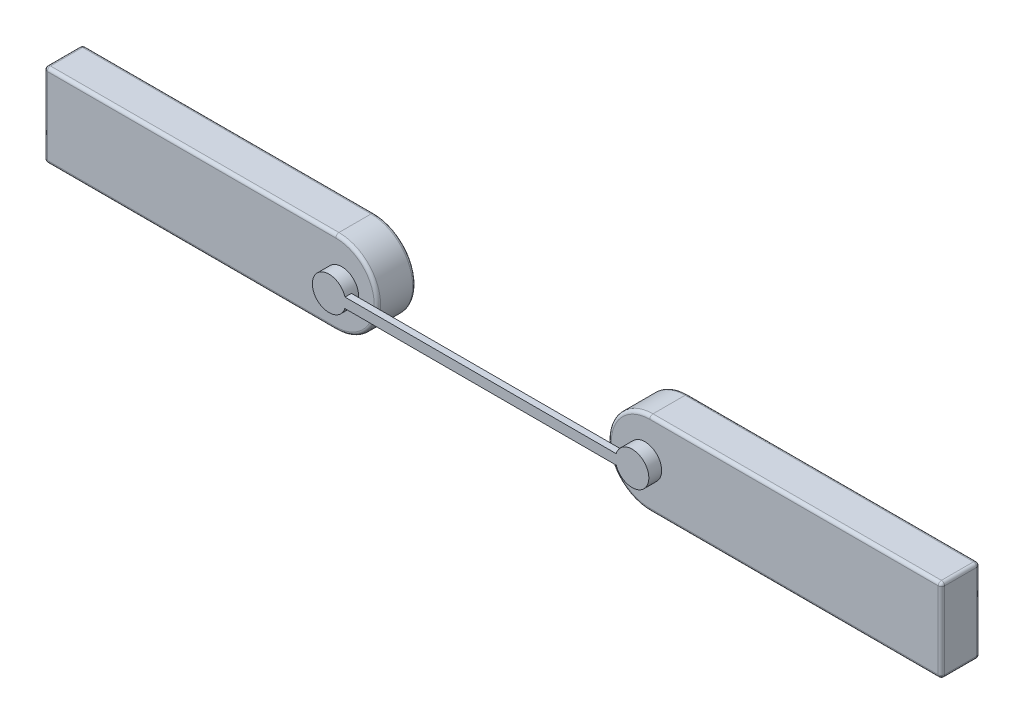
ISO-10303-21;
HEADER;
FILE_DESCRIPTION(('STEP AP214'),'2;1');
FILE_NAME('part.step','',(''),(''),'','','');
FILE_SCHEMA(('AUTOMOTIVE_DESIGN { 1 0 10303 214 1 1 1 1 }'));
ENDSEC;
DATA;
#1=APPLICATION_CONTEXT('core data for automotive mechanical design processes');
#2=APPLICATION_PROTOCOL_DEFINITION('international standard','automotive_design',2000,#1);
#3=PRODUCT_CONTEXT('',#1,'mechanical');
#4=PRODUCT('Part','Part','',(#3));
#5=PRODUCT_RELATED_PRODUCT_CATEGORY('part','',(#4));
#6=PRODUCT_DEFINITION_FORMATION('','',#4);
#7=PRODUCT_DEFINITION_CONTEXT('part definition',#1,'design');
#8=PRODUCT_DEFINITION('design','',#6,#7);
#9=PRODUCT_DEFINITION_SHAPE('','',#8);
#10=(LENGTH_UNIT() NAMED_UNIT(*) SI_UNIT(.MILLI.,.METRE.));
#11=(NAMED_UNIT(*) PLANE_ANGLE_UNIT() SI_UNIT($,.RADIAN.));
#12=(NAMED_UNIT(*) SI_UNIT($,.STERADIAN.) SOLID_ANGLE_UNIT());
#13=UNCERTAINTY_MEASURE_WITH_UNIT(LENGTH_MEASURE(1.E-05),#10,'distance_accuracy_value','');
#14=(GEOMETRIC_REPRESENTATION_CONTEXT(3) GLOBAL_UNCERTAINTY_ASSIGNED_CONTEXT((#13)) GLOBAL_UNIT_ASSIGNED_CONTEXT((#10,
#11,#12)) REPRESENTATION_CONTEXT('',''));
#15=CARTESIAN_POINT('',(0.,0.,0.));
#16=DIRECTION('',(0.,0.,1.));
#17=DIRECTION('',(1.,0.,0.));
#18=AXIS2_PLACEMENT_3D('',#15,#16,#17);
#19=CARTESIAN_POINT('',(-2.26404410227311,0.,0.));
#20=DIRECTION('',(0.,0.,1.));
#21=DIRECTION('',(1.,0.,0.));
#22=AXIS2_PLACEMENT_3D('',#19,#20,#21);
#23=PLANE('',#22);
#24=DIRECTION('',(1.,0.,0.));
#25=VECTOR('',#24,1.);
#26=CARTESIAN_POINT('',(-2.31327205113655,-0.3,0.));
#27=LINE('',#26,#25);
#28=CARTESIAN_POINT('',(-3.475,-0.3,0.));
#29=VERTEX_POINT('',#28);
#30=CARTESIAN_POINT('',(-1.225,-0.3,0.));
#31=VERTEX_POINT('',#30);
#32=EDGE_CURVE('E410',#29,#31,#27,.T.);
#33=ORIENTED_EDGE('',*,*,#32,.F.);
#34=DIRECTION('',(0.,1.,0.));
#35=VECTOR('',#34,1.);
#36=CARTESIAN_POINT('',(-3.475,0.,0.));
#37=LINE('',#36,#35);
#38=CARTESIAN_POINT('',(-3.475,0.3,0.));
#39=VERTEX_POINT('',#38);
#40=EDGE_CURVE('E499',#39,#29,#37,.F.);
#41=ORIENTED_EDGE('',*,*,#40,.F.);
#42=DIRECTION('',(-1.,0.,0.));
#43=VECTOR('',#42,1.);
#44=CARTESIAN_POINT('',(-2.31327205113655,0.3,0.));
#45=LINE('',#44,#43);
#46=CARTESIAN_POINT('',(-1.225,0.3,0.));
#47=VERTEX_POINT('',#46);
#48=EDGE_CURVE('E369',#47,#39,#45,.T.);
#49=ORIENTED_EDGE('',*,*,#48,.F.);
#50=CARTESIAN_POINT('',(-1.225,0.,0.));
#51=DIRECTION('',(0.,0.,1.));
#52=DIRECTION('',(0.,-1.,0.));
#53=AXIS2_PLACEMENT_3D('',#50,#51,#52);
#54=CIRCLE('',#53,0.3);
#55=EDGE_CURVE('E379',#31,#47,#54,.T.);
#56=ORIENTED_EDGE('',*,*,#55,.F.);
#57=EDGE_LOOP('',(#33,#41,#49,#56));
#58=FACE_BOUND('',#57,.T.);
#59=ADVANCED_FACE('F17',(#58),#23,.F.);
#60=CARTESIAN_POINT('',(-3.475,0.3,0.025));
#61=DIRECTION('',(1.,0.,0.));
#62=DIRECTION('',(0.,1.,0.));
#63=AXIS2_PLACEMENT_3D('',#60,#61,#62);
#64=SPHERICAL_SURFACE('',#63,0.025);
#65=CARTESIAN_POINT('',(-3.475,0.3,0.025));
#66=DIRECTION('',(0.,0.,-1.));
#67=DIRECTION('',(-1.,0.,0.));
#68=AXIS2_PLACEMENT_3D('',#65,#66,#67);
#69=CIRCLE('',#68,0.025);
#70=CARTESIAN_POINT('',(-3.475,0.325,0.025));
#71=VERTEX_POINT('',#70);
#72=CARTESIAN_POINT('',(-3.5,0.3,0.025));
#73=VERTEX_POINT('',#72);
#74=EDGE_CURVE('E361',#71,#73,#69,.F.);
#75=ORIENTED_EDGE('',*,*,#74,.F.);
#76=CARTESIAN_POINT('',(-3.475,0.3,0.025));
#77=DIRECTION('',(-1.,0.,0.));
#78=DIRECTION('',(0.,-1.,0.));
#79=AXIS2_PLACEMENT_3D('',#76,#77,#78);
#80=CIRCLE('',#79,0.025);
#81=EDGE_CURVE('E376',#39,#71,#80,.F.);
#82=ORIENTED_EDGE('',*,*,#81,.F.);
#83=CARTESIAN_POINT('',(-3.475,0.3,0.025));
#84=DIRECTION('',(0.,-1.,0.));
#85=DIRECTION('',(0.,0.,-1.));
#86=AXIS2_PLACEMENT_3D('',#83,#84,#85);
#87=CIRCLE('',#86,0.025);
#88=EDGE_CURVE('E351',#73,#39,#87,.T.);
#89=ORIENTED_EDGE('',*,*,#88,.F.);
#90=EDGE_LOOP('',(#75,#82,#89));
#91=FACE_BOUND('',#90,.T.);
#92=ADVANCED_FACE('F493',(#91),#64,.T.);
#93=CARTESIAN_POINT('',(-3.475,-0.3,0.025));
#94=DIRECTION('',(1.,0.,0.));
#95=DIRECTION('',(0.,1.,0.));
#96=AXIS2_PLACEMENT_3D('',#93,#94,#95);
#97=SPHERICAL_SURFACE('',#96,0.025);
#98=CARTESIAN_POINT('',(-3.475,-0.3,0.025));
#99=DIRECTION('',(0.,0.,-1.));
#100=DIRECTION('',(-1.,0.,0.));
#101=AXIS2_PLACEMENT_3D('',#98,#99,#100);
#102=CIRCLE('',#101,0.025);
#103=CARTESIAN_POINT('',(-3.5,-0.3,0.025));
#104=VERTEX_POINT('',#103);
#105=CARTESIAN_POINT('',(-3.475,-0.325,0.025));
#106=VERTEX_POINT('',#105);
#107=EDGE_CURVE('E347',#104,#106,#102,.F.);
#108=ORIENTED_EDGE('',*,*,#107,.F.);
#109=CARTESIAN_POINT('',(-3.475,-0.3,0.025));
#110=DIRECTION('',(0.,-1.,0.));
#111=DIRECTION('',(0.,0.,-1.));
#112=AXIS2_PLACEMENT_3D('',#109,#110,#111);
#113=CIRCLE('',#112,0.025);
#114=EDGE_CURVE('E359',#29,#104,#113,.F.);
#115=ORIENTED_EDGE('',*,*,#114,.F.);
#116=CARTESIAN_POINT('',(-3.475,-0.3,0.025));
#117=DIRECTION('',(1.,0.,0.));
#118=DIRECTION('',(0.,1.,0.));
#119=AXIS2_PLACEMENT_3D('',#116,#117,#118);
#120=CIRCLE('',#119,0.025);
#121=EDGE_CURVE('E417',#106,#29,#120,.T.);
#122=ORIENTED_EDGE('',*,*,#121,.F.);
#123=EDGE_LOOP('',(#108,#115,#122));
#124=FACE_BOUND('',#123,.T.);
#125=ADVANCED_FACE('F502',(#124),#97,.T.);
#126=CARTESIAN_POINT('',(-2.31327205113655,-0.3,0.025));
#127=DIRECTION('',(1.,0.,0.));
#128=DIRECTION('',(0.,1.,0.));
#129=AXIS2_PLACEMENT_3D('',#126,#127,#128);
#130=CYLINDRICAL_SURFACE('',#129,0.025);
#131=ORIENTED_EDGE('',*,*,#121,.T.);
#132=ORIENTED_EDGE('',*,*,#32,.T.);
#133=CARTESIAN_POINT('',(-1.225,-0.3,0.025));
#134=DIRECTION('',(1.,0.,0.));
#135=DIRECTION('',(0.,-1.,0.));
#136=AXIS2_PLACEMENT_3D('',#133,#134,#135);
#137=CIRCLE('',#136,0.025);
#138=CARTESIAN_POINT('',(-1.225,-0.325,0.025));
#139=VERTEX_POINT('',#138);
#140=EDGE_CURVE('E391',#139,#31,#137,.T.);
#141=ORIENTED_EDGE('',*,*,#140,.F.);
#142=DIRECTION('',(1.,0.,0.));
#143=VECTOR('',#142,1.);
#144=CARTESIAN_POINT('',(-2.3625,-0.325,0.025));
#145=LINE('',#144,#143);
#146=EDGE_CURVE('E338',#106,#139,#145,.T.);
#147=ORIENTED_EDGE('',*,*,#146,.F.);
#148=EDGE_LOOP('',(#131,#132,#141,#147));
#149=FACE_BOUND('',#148,.T.);
#150=ADVANCED_FACE('F400',(#149),#130,.T.);
#151=CARTESIAN_POINT('',(-1.225,0.,0.025));
#152=DIRECTION('',(0.,0.,1.));
#153=DIRECTION('',(1.,0.,0.));
#154=AXIS2_PLACEMENT_3D('',#151,#152,#153);
#155=TOROIDAL_SURFACE('',#154,0.3,0.025);
#156=CARTESIAN_POINT('',(-1.225,0.3,0.025));
#157=DIRECTION('',(-1.,0.,0.));
#158=DIRECTION('',(0.,-1.,0.));
#159=AXIS2_PLACEMENT_3D('',#156,#157,#158);
#160=CIRCLE('',#159,0.025);
#161=CARTESIAN_POINT('',(-1.225,0.325,0.025));
#162=VERTEX_POINT('',#161);
#163=EDGE_CURVE('E378',#162,#47,#160,.T.);
#164=ORIENTED_EDGE('',*,*,#163,.F.);
#165=CARTESIAN_POINT('',(-1.225,0.,0.025));
#166=DIRECTION('',(0.,0.,-1.));
#167=DIRECTION('',(-1.,0.,0.));
#168=AXIS2_PLACEMENT_3D('',#165,#166,#167);
#169=CIRCLE('',#168,0.325);
#170=EDGE_CURVE('E329',#139,#162,#169,.F.);
#171=ORIENTED_EDGE('',*,*,#170,.F.);
#172=ORIENTED_EDGE('',*,*,#140,.T.);
#173=ORIENTED_EDGE('',*,*,#55,.T.);
#174=EDGE_LOOP('',(#164,#171,#172,#173));
#175=FACE_BOUND('',#174,.T.);
#176=ADVANCED_FACE('F394',(#175),#155,.T.);
#177=CARTESIAN_POINT('',(-2.31327205113655,0.3,0.025));
#178=DIRECTION('',(-1.,0.,0.));
#179=DIRECTION('',(0.,-1.,0.));
#180=AXIS2_PLACEMENT_3D('',#177,#178,#179);
#181=CYLINDRICAL_SURFACE('',#180,0.025);
#182=ORIENTED_EDGE('',*,*,#163,.T.);
#183=ORIENTED_EDGE('',*,*,#48,.T.);
#184=ORIENTED_EDGE('',*,*,#81,.T.);
#185=DIRECTION('',(-1.,0.,0.));
#186=VECTOR('',#185,1.);
#187=CARTESIAN_POINT('',(-2.3625,0.325,0.025));
#188=LINE('',#187,#186);
#189=EDGE_CURVE('E323',#162,#71,#188,.T.);
#190=ORIENTED_EDGE('',*,*,#189,.F.);
#191=EDGE_LOOP('',(#182,#183,#184,#190));
#192=FACE_BOUND('',#191,.T.);
#193=ADVANCED_FACE('F399',(#192),#181,.T.);
#194=CARTESIAN_POINT('',(-3.475,0.3,0.3));
#195=DIRECTION('',(0.,0.,-1.));
#196=DIRECTION('',(-1.,0.,0.));
#197=AXIS2_PLACEMENT_3D('',#194,#195,#196);
#198=CYLINDRICAL_SURFACE('',#197,0.025);
#199=CARTESIAN_POINT('',(-3.475,0.3,0.275));
#200=DIRECTION('',(0.,0.,1.));
#201=DIRECTION('',(1.,0.,0.));
#202=AXIS2_PLACEMENT_3D('',#199,#200,#201);
#203=CIRCLE('',#202,0.025);
#204=CARTESIAN_POINT('',(-3.475,0.325,0.275));
#205=VERTEX_POINT('',#204);
#206=CARTESIAN_POINT('',(-3.5,0.3,0.275));
#207=VERTEX_POINT('',#206);
#208=EDGE_CURVE('E287',#205,#207,#203,.T.);
#209=ORIENTED_EDGE('',*,*,#208,.F.);
#210=DIRECTION('',(0.,0.,1.));
#211=VECTOR('',#210,1.);
#212=CARTESIAN_POINT('',(-3.475,0.325,0.3));
#213=LINE('',#212,#211);
#214=EDGE_CURVE('E309',#71,#205,#213,.T.);
#215=ORIENTED_EDGE('',*,*,#214,.F.);
#216=ORIENTED_EDGE('',*,*,#74,.T.);
#217=DIRECTION('',(0.,0.,1.));
#218=VECTOR('',#217,1.);
#219=CARTESIAN_POINT('',(-3.5,0.3,0.3));
#220=LINE('',#219,#218);
#221=EDGE_CURVE('E356',#207,#73,#220,.F.);
#222=ORIENTED_EDGE('',*,*,#221,.F.);
#223=EDGE_LOOP('',(#209,#215,#216,#222));
#224=FACE_BOUND('',#223,.T.);
#225=ADVANCED_FACE('F481',(#224),#198,.T.);
#226=CARTESIAN_POINT('',(-3.475,-0.0812499999999997,0.025));
#227=DIRECTION('',(0.,-1.,0.));
#228=DIRECTION('',(0.,0.,-1.));
#229=AXIS2_PLACEMENT_3D('',#226,#227,#228);
#230=CYLINDRICAL_SURFACE('',#229,0.025);
#231=ORIENTED_EDGE('',*,*,#88,.T.);
#232=ORIENTED_EDGE('',*,*,#40,.T.);
#233=ORIENTED_EDGE('',*,*,#114,.T.);
#234=DIRECTION('',(0.,1.,0.));
#235=VECTOR('',#234,1.);
#236=CARTESIAN_POINT('',(-3.5,-0.1625,0.025));
#237=LINE('',#236,#235);
#238=EDGE_CURVE('E313',#73,#104,#237,.F.);
#239=ORIENTED_EDGE('',*,*,#238,.F.);
#240=EDGE_LOOP('',(#231,#232,#233,#239));
#241=FACE_BOUND('',#240,.T.);
#242=ADVANCED_FACE('F497',(#241),#230,.T.);
#243=CARTESIAN_POINT('',(-3.475,-0.3,0.3));
#244=DIRECTION('',(0.,0.,-1.));
#245=DIRECTION('',(-1.,0.,0.));
#246=AXIS2_PLACEMENT_3D('',#243,#244,#245);
#247=CYLINDRICAL_SURFACE('',#246,0.025);
#248=CARTESIAN_POINT('',(-3.475,-0.3,0.275));
#249=DIRECTION('',(0.,0.,-1.));
#250=DIRECTION('',(1.,0.,0.));
#251=AXIS2_PLACEMENT_3D('',#248,#249,#250);
#252=CIRCLE('',#251,0.025);
#253=CARTESIAN_POINT('',(-3.5,-0.3,0.275));
#254=VERTEX_POINT('',#253);
#255=CARTESIAN_POINT('',(-3.475,-0.325,0.275));
#256=VERTEX_POINT('',#255);
#257=EDGE_CURVE('E307',#254,#256,#252,.F.);
#258=ORIENTED_EDGE('',*,*,#257,.F.);
#259=DIRECTION('',(0.,0.,1.));
#260=VECTOR('',#259,1.);
#261=CARTESIAN_POINT('',(-3.5,-0.3,0.3));
#262=LINE('',#261,#260);
#263=EDGE_CURVE('E276',#104,#254,#262,.T.);
#264=ORIENTED_EDGE('',*,*,#263,.F.);
#265=ORIENTED_EDGE('',*,*,#107,.T.);
#266=DIRECTION('',(0.,0.,1.));
#267=VECTOR('',#266,1.);
#268=CARTESIAN_POINT('',(-3.475,-0.325,0.3));
#269=LINE('',#268,#267);
#270=EDGE_CURVE('E344',#256,#106,#269,.F.);
#271=ORIENTED_EDGE('',*,*,#270,.F.);
#272=EDGE_LOOP('',(#258,#264,#265,#271));
#273=FACE_BOUND('',#272,.T.);
#274=ADVANCED_FACE('F464',(#273),#247,.T.);
#275=CARTESIAN_POINT('',(-2.3625,-0.325,0.3));
#276=DIRECTION('',(0.,-1.,0.));
#277=DIRECTION('',(1.,0.,0.));
#278=AXIS2_PLACEMENT_3D('',#275,#276,#277);
#279=PLANE('',#278);
#280=ORIENTED_EDGE('',*,*,#146,.T.);
#281=DIRECTION('',(0.,0.,-1.));
#282=VECTOR('',#281,1.);
#283=CARTESIAN_POINT('',(-1.225,-0.325,0.3));
#284=LINE('',#283,#282);
#285=CARTESIAN_POINT('',(-1.225,-0.325,0.275));
#286=VERTEX_POINT('',#285);
#287=EDGE_CURVE('E335',#286,#139,#284,.T.);
#288=ORIENTED_EDGE('',*,*,#287,.F.);
#289=DIRECTION('',(1.,0.,0.));
#290=VECTOR('',#289,1.);
#291=CARTESIAN_POINT('',(-2.31327205113655,-0.325,0.275));
#292=LINE('',#291,#290);
#293=EDGE_CURVE('E270',#256,#286,#292,.T.);
#294=ORIENTED_EDGE('',*,*,#293,.F.);
#295=ORIENTED_EDGE('',*,*,#270,.T.);
#296=EDGE_LOOP('',(#280,#288,#294,#295));
#297=FACE_BOUND('',#296,.T.);
#298=ADVANCED_FACE('F470',(#297),#279,.T.);
#299=CARTESIAN_POINT('',(-1.225,0.,0.3));
#300=DIRECTION('',(0.,0.,-1.));
#301=DIRECTION('',(-1.,0.,0.));
#302=AXIS2_PLACEMENT_3D('',#299,#300,#301);
#303=CYLINDRICAL_SURFACE('',#302,0.325);
#304=ORIENTED_EDGE('',*,*,#170,.T.);
#305=DIRECTION('',(0.,0.,1.));
#306=VECTOR('',#305,1.);
#307=CARTESIAN_POINT('',(-1.225,0.325,0.3));
#308=LINE('',#307,#306);
#309=CARTESIAN_POINT('',(-1.225,0.325,0.275));
#310=VERTEX_POINT('',#309);
#311=EDGE_CURVE('E326',#310,#162,#308,.F.);
#312=ORIENTED_EDGE('',*,*,#311,.F.);
#313=CARTESIAN_POINT('',(-1.225,0.,0.275));
#314=DIRECTION('',(0.,0.,-1.));
#315=DIRECTION('',(1.,0.,0.));
#316=AXIS2_PLACEMENT_3D('',#313,#314,#315);
#317=CIRCLE('',#316,0.325);
#318=EDGE_CURVE('E269',#286,#310,#317,.F.);
#319=ORIENTED_EDGE('',*,*,#318,.F.);
#320=ORIENTED_EDGE('',*,*,#287,.T.);
#321=EDGE_LOOP('',(#304,#312,#319,#320));
#322=FACE_BOUND('',#321,.T.);
#323=ADVANCED_FACE('F476',(#322),#303,.T.);
#324=CARTESIAN_POINT('',(-2.3625,0.325,0.3));
#325=DIRECTION('',(0.,1.,0.));
#326=DIRECTION('',(-1.,0.,0.));
#327=AXIS2_PLACEMENT_3D('',#324,#325,#326);
#328=PLANE('',#327);
#329=ORIENTED_EDGE('',*,*,#189,.T.);
#330=ORIENTED_EDGE('',*,*,#214,.T.);
#331=DIRECTION('',(-1.,0.,0.));
#332=VECTOR('',#331,1.);
#333=CARTESIAN_POINT('',(-2.31327205113655,0.325,0.275));
#334=LINE('',#333,#332);
#335=EDGE_CURVE('E316',#310,#205,#334,.T.);
#336=ORIENTED_EDGE('',*,*,#335,.F.);
#337=ORIENTED_EDGE('',*,*,#311,.T.);
#338=EDGE_LOOP('',(#329,#330,#336,#337));
#339=FACE_BOUND('',#338,.T.);
#340=ADVANCED_FACE('F299',(#339),#328,.T.);
#341=CARTESIAN_POINT('',(-3.475,-0.3,0.275));
#342=DIRECTION('',(1.,0.,0.));
#343=DIRECTION('',(0.,1.,0.));
#344=AXIS2_PLACEMENT_3D('',#341,#342,#343);
#345=SPHERICAL_SURFACE('',#344,0.025);
#346=CARTESIAN_POINT('',(-3.475,-0.3,0.275));
#347=DIRECTION('',(1.,0.,0.));
#348=DIRECTION('',(0.,1.,0.));
#349=AXIS2_PLACEMENT_3D('',#346,#347,#348);
#350=CIRCLE('',#349,0.025);
#351=CARTESIAN_POINT('',(-3.475,-0.3,0.3));
#352=VERTEX_POINT('',#351);
#353=EDGE_CURVE('E273',#352,#256,#350,.T.);
#354=ORIENTED_EDGE('',*,*,#353,.F.);
#355=CARTESIAN_POINT('',(-3.475,-0.3,0.275));
#356=DIRECTION('',(0.,-1.,0.));
#357=DIRECTION('',(0.,0.,-1.));
#358=AXIS2_PLACEMENT_3D('',#355,#356,#357);
#359=CIRCLE('',#358,0.025);
#360=EDGE_CURVE('E279',#254,#352,#359,.F.);
#361=ORIENTED_EDGE('',*,*,#360,.F.);
#362=ORIENTED_EDGE('',*,*,#257,.T.);
#363=EDGE_LOOP('',(#354,#361,#362));
#364=FACE_BOUND('',#363,.T.);
#365=ADVANCED_FACE('F294',(#364),#345,.T.);
#366=CARTESIAN_POINT('',(-3.475,0.3,0.275));
#367=DIRECTION('',(1.,0.,0.));
#368=DIRECTION('',(0.,1.,0.));
#369=AXIS2_PLACEMENT_3D('',#366,#367,#368);
#370=SPHERICAL_SURFACE('',#369,0.025);
#371=CARTESIAN_POINT('',(-3.475,0.3,0.275));
#372=DIRECTION('',(-1.,0.,0.));
#373=DIRECTION('',(0.,-1.,0.));
#374=AXIS2_PLACEMENT_3D('',#371,#372,#373);
#375=CIRCLE('',#374,0.025);
#376=CARTESIAN_POINT('',(-3.475,0.3,0.3));
#377=VERTEX_POINT('',#376);
#378=EDGE_CURVE('E282',#205,#377,#375,.F.);
#379=ORIENTED_EDGE('',*,*,#378,.F.);
#380=ORIENTED_EDGE('',*,*,#208,.T.);
#381=CARTESIAN_POINT('',(-3.475,0.3,0.275));
#382=DIRECTION('',(0.,-1.,0.));
#383=DIRECTION('',(0.,0.,-1.));
#384=AXIS2_PLACEMENT_3D('',#381,#382,#383);
#385=CIRCLE('',#384,0.025);
#386=EDGE_CURVE('E281',#377,#207,#385,.T.);
#387=ORIENTED_EDGE('',*,*,#386,.F.);
#388=EDGE_LOOP('',(#379,#380,#387));
#389=FACE_BOUND('',#388,.T.);
#390=ADVANCED_FACE('F290',(#389),#370,.T.);
#391=CARTESIAN_POINT('',(-3.5,-0.1625,0.3));
#392=DIRECTION('',(-1.,0.,0.));
#393=DIRECTION('',(0.,0.,1.));
#394=AXIS2_PLACEMENT_3D('',#391,#392,#393);
#395=PLANE('',#394);
#396=ORIENTED_EDGE('',*,*,#263,.T.);
#397=DIRECTION('',(0.,-1.,0.));
#398=VECTOR('',#397,1.);
#399=CARTESIAN_POINT('',(-3.5,-0.0812499999999997,0.275));
#400=LINE('',#399,#398);
#401=EDGE_CURVE('E184',#207,#254,#400,.T.);
#402=ORIENTED_EDGE('',*,*,#401,.F.);
#403=ORIENTED_EDGE('',*,*,#221,.T.);
#404=ORIENTED_EDGE('',*,*,#238,.T.);
#405=EDGE_LOOP('',(#396,#402,#403,#404));
#406=FACE_BOUND('',#405,.T.);
#407=ADVANCED_FACE('F293',(#406),#395,.T.);
#408=CARTESIAN_POINT('',(-2.31327205113655,-0.3,0.275));
#409=DIRECTION('',(1.,0.,0.));
#410=DIRECTION('',(0.,1.,0.));
#411=AXIS2_PLACEMENT_3D('',#408,#409,#410);
#412=CYLINDRICAL_SURFACE('',#411,0.025);
#413=ORIENTED_EDGE('',*,*,#353,.T.);
#414=ORIENTED_EDGE('',*,*,#293,.T.);
#415=CARTESIAN_POINT('',(-1.225,-0.3,0.275));
#416=DIRECTION('',(-1.,0.,0.));
#417=DIRECTION('',(0.,-1.,0.));
#418=AXIS2_PLACEMENT_3D('',#415,#416,#417);
#419=CIRCLE('',#418,0.025);
#420=CARTESIAN_POINT('',(-1.225,-0.3,0.3));
#421=VERTEX_POINT('',#420);
#422=EDGE_CURVE('E262',#421,#286,#419,.F.);
#423=ORIENTED_EDGE('',*,*,#422,.F.);
#424=DIRECTION('',(1.,0.,0.));
#425=VECTOR('',#424,1.);
#426=CARTESIAN_POINT('',(-2.26404410227311,-0.3,0.3));
#427=LINE('',#426,#425);
#428=EDGE_CURVE('E429',#352,#421,#427,.T.);
#429=ORIENTED_EDGE('',*,*,#428,.F.);
#430=EDGE_LOOP('',(#413,#414,#423,#429));
#431=FACE_BOUND('',#430,.T.);
#432=ADVANCED_FACE('F249',(#431),#412,.T.);
#433=CARTESIAN_POINT('',(-1.225,0.,0.275));
#434=DIRECTION('',(0.,0.,-1.));
#435=DIRECTION('',(1.,0.,0.));
#436=AXIS2_PLACEMENT_3D('',#433,#434,#435);
#437=TOROIDAL_SURFACE('',#436,0.3,0.025);
#438=CARTESIAN_POINT('',(-1.225,0.3,0.275));
#439=DIRECTION('',(-1.,0.,0.));
#440=DIRECTION('',(0.,-1.,0.));
#441=AXIS2_PLACEMENT_3D('',#438,#439,#440);
#442=CIRCLE('',#441,0.025);
#443=CARTESIAN_POINT('',(-1.225,0.3,0.3));
#444=VERTEX_POINT('',#443);
#445=EDGE_CURVE('E319',#444,#310,#442,.T.);
#446=ORIENTED_EDGE('',*,*,#445,.F.);
#447=CARTESIAN_POINT('',(-1.225,0.,0.3));
#448=DIRECTION('',(0.,0.,-1.));
#449=DIRECTION('',(0.,1.,0.));
#450=AXIS2_PLACEMENT_3D('',#447,#448,#449);
#451=CIRCLE('',#450,0.3);
#452=EDGE_CURVE('E215',#421,#444,#451,.F.);
#453=ORIENTED_EDGE('',*,*,#452,.F.);
#454=ORIENTED_EDGE('',*,*,#422,.T.);
#455=ORIENTED_EDGE('',*,*,#318,.T.);
#456=EDGE_LOOP('',(#446,#453,#454,#455));
#457=FACE_BOUND('',#456,.T.);
#458=ADVANCED_FACE('F243',(#457),#437,.T.);
#459=CARTESIAN_POINT('',(-2.31327205113655,0.3,0.275));
#460=DIRECTION('',(-1.,0.,0.));
#461=DIRECTION('',(0.,-1.,0.));
#462=AXIS2_PLACEMENT_3D('',#459,#460,#461);
#463=CYLINDRICAL_SURFACE('',#462,0.025);
#464=ORIENTED_EDGE('',*,*,#378,.T.);
#465=DIRECTION('',(1.,0.,0.));
#466=VECTOR('',#465,1.);
#467=CARTESIAN_POINT('',(-2.26404410227311,0.3,0.3));
#468=LINE('',#467,#466);
#469=EDGE_CURVE('E221',#444,#377,#468,.F.);
#470=ORIENTED_EDGE('',*,*,#469,.F.);
#471=ORIENTED_EDGE('',*,*,#445,.T.);
#472=ORIENTED_EDGE('',*,*,#335,.T.);
#473=EDGE_LOOP('',(#464,#470,#471,#472));
#474=FACE_BOUND('',#473,.T.);
#475=ADVANCED_FACE('F239',(#474),#463,.T.);
#476=CARTESIAN_POINT('',(-3.475,-0.0812499999999997,0.275));
#477=DIRECTION('',(0.,-1.,0.));
#478=DIRECTION('',(0.,0.,-1.));
#479=AXIS2_PLACEMENT_3D('',#476,#477,#478);
#480=CYLINDRICAL_SURFACE('',#479,0.025);
#481=ORIENTED_EDGE('',*,*,#386,.T.);
#482=ORIENTED_EDGE('',*,*,#401,.T.);
#483=ORIENTED_EDGE('',*,*,#360,.T.);
#484=DIRECTION('',(0.,1.,0.));
#485=VECTOR('',#484,1.);
#486=CARTESIAN_POINT('',(-3.475,0.,0.3));
#487=LINE('',#486,#485);
#488=EDGE_CURVE('E208',#377,#352,#487,.F.);
#489=ORIENTED_EDGE('',*,*,#488,.F.);
#490=EDGE_LOOP('',(#481,#482,#483,#489));
#491=FACE_BOUND('',#490,.T.);
#492=ADVANCED_FACE('F236',(#491),#480,.T.);
#493=CARTESIAN_POINT('',(-1.17754991258794,0.,0.4));
#494=DIRECTION('',(0.,0.,1.));
#495=DIRECTION('',(1.,0.,0.));
#496=AXIS2_PLACEMENT_3D('',#493,#494,#495);
#497=PLANE('',#496);
#498=DIRECTION('',(1.,0.,0.));
#499=VECTOR('',#498,1.);
#500=CARTESIAN_POINT('',(-0.00188594796703023,-0.0405715299206022,0.4));
#501=LINE('',#500,#499);
#502=CARTESIAN_POINT('',(1.06361107278188,-0.0405715299206022,0.4));
#503=VERTEX_POINT('',#502);
#504=CARTESIAN_POINT('',(-1.05394264045783,-0.0405715299206012,0.4));
#505=VERTEX_POINT('',#504);
#506=EDGE_CURVE('E179',#503,#505,#501,.F.);
#507=ORIENTED_EDGE('',*,*,#506,.F.);
#508=CARTESIAN_POINT('',(1.187218344912,0.,0.4));
#509=DIRECTION('',(0.,0.,1.));
#510=DIRECTION('',(0.,-1.,0.));
#511=AXIS2_PLACEMENT_3D('',#508,#509,#510);
#512=CIRCLE('',#511,0.130095375642435);
#513=CARTESIAN_POINT('',(1.06254152609611,0.0371550482908656,0.4));
#514=VERTEX_POINT('',#513);
#515=EDGE_CURVE('E183',#503,#514,#512,.T.);
#516=ORIENTED_EDGE('',*,*,#515,.T.);
#517=DIRECTION('',(1.,0.,0.));
#518=VECTOR('',#517,1.);
#519=CARTESIAN_POINT('',(-0.00188594796703023,0.0371550482908656,0.4));
#520=LINE('',#519,#518);
#521=CARTESIAN_POINT('',(-1.05287309377205,0.0371550482908653,0.4));
#522=VERTEX_POINT('',#521);
#523=EDGE_CURVE('E181',#522,#514,#520,.T.);
#524=ORIENTED_EDGE('',*,*,#523,.F.);
#525=CARTESIAN_POINT('',(-1.17754991258794,0.,0.4));
#526=DIRECTION('',(0.,0.,1.));
#527=DIRECTION('',(0.,-1.,0.));
#528=AXIS2_PLACEMENT_3D('',#525,#526,#527);
#529=CIRCLE('',#528,0.130095375642435);
#530=EDGE_CURVE('E21',#522,#505,#529,.T.);
#531=ORIENTED_EDGE('',*,*,#530,.T.);
#532=EDGE_LOOP('',(#507,#516,#524,#531));
#533=FACE_BOUND('',#532,.T.);
#534=ADVANCED_FACE('F178',(#533),#497,.T.);
#535=CARTESIAN_POINT('',(-2.26404410227311,0.,0.3));
#536=DIRECTION('',(0.,0.,1.));
#537=DIRECTION('',(1.,0.,0.));
#538=AXIS2_PLACEMENT_3D('',#535,#536,#537);
#539=PLANE('',#538);
#540=ORIENTED_EDGE('',*,*,#469,.T.);
#541=ORIENTED_EDGE('',*,*,#488,.T.);
#542=ORIENTED_EDGE('',*,*,#428,.T.);
#543=ORIENTED_EDGE('',*,*,#452,.T.);
#544=EDGE_LOOP('',(#540,#541,#542,#543));
#545=FACE_BOUND('',#544,.T.);
#546=CARTESIAN_POINT('',(-1.17754991258794,0.,0.3));
#547=DIRECTION('',(0.,0.,1.));
#548=DIRECTION('',(0.,-1.,0.));
#549=AXIS2_PLACEMENT_3D('',#546,#547,#548);
#550=CIRCLE('',#549,0.130095375642435);
#551=CARTESIAN_POINT('',(-1.17754991258794,-0.130095375642435,0.3));
#552=VERTEX_POINT('',#551);
#553=EDGE_CURVE('E203',#552,#552,#550,.T.);
#554=ORIENTED_EDGE('',*,*,#553,.F.);
#555=EDGE_LOOP('',(#554));
#556=FACE_BOUND('',#555,.T.);
#557=ADVANCED_FACE('F223',(#545,#556),#539,.T.);
#558=CARTESIAN_POINT('',(-0.00188594796703023,-0.0405715299206022,0.4));
#559=DIRECTION('',(0.,-1.,0.));
#560=DIRECTION('',(0.,0.,-1.));
#561=AXIS2_PLACEMENT_3D('',#558,#559,#560);
#562=PLANE('',#561);
#563=DIRECTION('',(0.,0.,-1.));
#564=VECTOR('',#563,1.);
#565=CARTESIAN_POINT('',(1.06361107278188,-0.0405715299206022,0.4));
#566=LINE('',#565,#564);
#567=CARTESIAN_POINT('',(1.06361107278188,-0.0405715299206022,0.35));
#568=VERTEX_POINT('',#567);
#569=EDGE_CURVE('E191',#568,#503,#566,.F.);
#570=ORIENTED_EDGE('',*,*,#569,.T.);
#571=ORIENTED_EDGE('',*,*,#506,.T.);
#572=DIRECTION('',(0.,0.,1.));
#573=VECTOR('',#572,1.);
#574=CARTESIAN_POINT('',(-1.05394264045783,-0.0405715299206003,0.3));
#575=LINE('',#574,#573);
#576=CARTESIAN_POINT('',(-1.05394264045783,-0.0405715299206012,0.35));
#577=VERTEX_POINT('',#576);
#578=EDGE_CURVE('E189',#577,#505,#575,.T.);
#579=ORIENTED_EDGE('',*,*,#578,.F.);
#580=DIRECTION('',(1.,0.,0.));
#581=VECTOR('',#580,1.);
#582=CARTESIAN_POINT('',(-0.00188594796703023,-0.0405715299206022,0.35));
#583=LINE('',#582,#581);
#584=EDGE_CURVE('E198',#577,#568,#583,.T.);
#585=ORIENTED_EDGE('',*,*,#584,.T.);
#586=EDGE_LOOP('',(#570,#571,#579,#585));
#587=FACE_BOUND('',#586,.T.);
#588=ADVANCED_FACE('F187',(#587),#562,.T.);
#589=CARTESIAN_POINT('',(-0.00188594796703023,0.0371550482908656,0.4));
#590=DIRECTION('',(0.,1.,0.));
#591=DIRECTION('',(0.,0.,1.));
#592=AXIS2_PLACEMENT_3D('',#589,#590,#591);
#593=PLANE('',#592);
#594=DIRECTION('',(0.,0.,1.));
#595=VECTOR('',#594,1.);
#596=CARTESIAN_POINT('',(1.06254152609611,0.0371550482908656,0.4));
#597=LINE('',#596,#595);
#598=CARTESIAN_POINT('',(1.06254152609611,0.0371550482908656,0.35));
#599=VERTEX_POINT('',#598);
#600=EDGE_CURVE('E206',#514,#599,#597,.F.);
#601=ORIENTED_EDGE('',*,*,#600,.T.);
#602=DIRECTION('',(1.,0.,0.));
#603=VECTOR('',#602,1.);
#604=CARTESIAN_POINT('',(-0.00188594796703023,0.0371550482908656,0.35));
#605=LINE('',#604,#603);
#606=CARTESIAN_POINT('',(-1.05287309377205,0.0371550482908653,0.35));
#607=VERTEX_POINT('',#606);
#608=EDGE_CURVE('E201',#599,#607,#605,.F.);
#609=ORIENTED_EDGE('',*,*,#608,.T.);
#610=DIRECTION('',(0.,0.,1.));
#611=VECTOR('',#610,1.);
#612=CARTESIAN_POINT('',(-1.05287309377205,0.037155048290865,0.3));
#613=LINE('',#612,#611);
#614=EDGE_CURVE('E199',#522,#607,#613,.F.);
#615=ORIENTED_EDGE('',*,*,#614,.F.);
#616=ORIENTED_EDGE('',*,*,#523,.T.);
#617=EDGE_LOOP('',(#601,#609,#615,#616));
#618=FACE_BOUND('',#617,.T.);
#619=ADVANCED_FACE('F716',(#618),#593,.T.);
#620=CARTESIAN_POINT('',(-1.17754991258794,0.,0.3));
#621=DIRECTION('',(0.,0.,1.));
#622=DIRECTION('',(0.,-1.,0.));
#623=AXIS2_PLACEMENT_3D('',#620,#621,#622);
#624=CYLINDRICAL_SURFACE('',#623,0.130095375642435);
#625=ORIENTED_EDGE('',*,*,#578,.T.);
#626=ORIENTED_EDGE('',*,*,#530,.F.);
#627=ORIENTED_EDGE('',*,*,#614,.T.);
#628=CARTESIAN_POINT('',(-1.17754991258794,0.,0.35));
#629=DIRECTION('',(0.,0.,1.));
#630=DIRECTION('',(0.,-1.,0.));
#631=AXIS2_PLACEMENT_3D('',#628,#629,#630);
#632=CIRCLE('',#631,0.130095375642435);
#633=EDGE_CURVE('E197',#607,#577,#632,.F.);
#634=ORIENTED_EDGE('',*,*,#633,.T.);
#635=EDGE_LOOP('',(#625,#626,#627,#634));
#636=FACE_BOUND('',#635,.T.);
#637=ORIENTED_EDGE('',*,*,#553,.T.);
#638=EDGE_LOOP('',(#637));
#639=FACE_BOUND('',#638,.T.);
#640=ADVANCED_FACE('F194',(#636,#639),#624,.T.);
#641=CARTESIAN_POINT('',(-0.00188594796703023,-0.00170824081486831,0.35));
#642=DIRECTION('',(0.,0.,1.));
#643=DIRECTION('',(1.,0.,0.));
#644=AXIS2_PLACEMENT_3D('',#641,#642,#643);
#645=PLANE('',#644);
#646=ORIENTED_EDGE('',*,*,#608,.F.);
#647=CARTESIAN_POINT('',(1.187218344912,0.,0.35));
#648=DIRECTION('',(0.,0.,1.));
#649=DIRECTION('',(0.,-1.,0.));
#650=AXIS2_PLACEMENT_3D('',#647,#648,#649);
#651=CIRCLE('',#650,0.130095375642435);
#652=EDGE_CURVE('E424',#568,#599,#651,.F.);
#653=ORIENTED_EDGE('',*,*,#652,.F.);
#654=ORIENTED_EDGE('',*,*,#584,.F.);
#655=ORIENTED_EDGE('',*,*,#633,.F.);
#656=EDGE_LOOP('',(#646,#653,#654,#655));
#657=FACE_BOUND('',#656,.T.);
#658=ADVANCED_FACE('F720',(#657),#645,.F.);
#659=CARTESIAN_POINT('',(1.187218344912,0.,0.3));
#660=DIRECTION('',(0.,0.,1.));
#661=DIRECTION('',(0.,-1.,0.));
#662=AXIS2_PLACEMENT_3D('',#659,#660,#661);
#663=CYLINDRICAL_SURFACE('',#662,0.130095375642435);
#664=CARTESIAN_POINT('',(1.187218344912,0.,0.3));
#665=DIRECTION('',(0.,0.,1.));
#666=DIRECTION('',(0.,-1.,0.));
#667=AXIS2_PLACEMENT_3D('',#664,#665,#666);
#668=CIRCLE('',#667,0.130095375642435);
#669=CARTESIAN_POINT('',(1.187218344912,-0.130095375642435,0.3));
#670=VERTEX_POINT('',#669);
#671=EDGE_CURVE('E420',#670,#670,#668,.F.);
#672=ORIENTED_EDGE('',*,*,#671,.F.);
#673=EDGE_LOOP('',(#672));
#674=FACE_BOUND('',#673,.T.);
#675=ORIENTED_EDGE('',*,*,#569,.F.);
#676=ORIENTED_EDGE('',*,*,#652,.T.);
#677=ORIENTED_EDGE('',*,*,#600,.F.);
#678=ORIENTED_EDGE('',*,*,#515,.F.);
#679=EDGE_LOOP('',(#675,#676,#677,#678));
#680=FACE_BOUND('',#679,.T.);
#681=ADVANCED_FACE('F722',(#674,#680),#663,.T.);
#682=CARTESIAN_POINT('',(3.475,-0.3,0.275));
#683=DIRECTION('',(1.,0.,0.));
#684=DIRECTION('',(0.,1.,0.));
#685=AXIS2_PLACEMENT_3D('',#682,#683,#684);
#686=SPHERICAL_SURFACE('',#685,0.025);
#687=CARTESIAN_POINT('',(3.475,-0.3,0.275));
#688=DIRECTION('',(1.,0.,0.));
#689=DIRECTION('',(0.,1.,0.));
#690=AXIS2_PLACEMENT_3D('',#687,#688,#689);
#691=CIRCLE('',#690,0.025);
#692=CARTESIAN_POINT('',(3.475,-0.325,0.275));
#693=VERTEX_POINT('',#692);
#694=CARTESIAN_POINT('',(3.475,-0.300000000000016,0.3));
#695=VERTEX_POINT('',#694);
#696=EDGE_CURVE('E1042',#693,#695,#691,.F.);
#697=ORIENTED_EDGE('',*,*,#696,.F.);
#698=CARTESIAN_POINT('',(3.475,-0.3,0.275));
#699=DIRECTION('',(0.,0.,-1.));
#700=DIRECTION('',(-1.,0.,0.));
#701=AXIS2_PLACEMENT_3D('',#698,#699,#700);
#702=CIRCLE('',#701,0.025);
#703=CARTESIAN_POINT('',(3.5,-0.3,0.275));
#704=VERTEX_POINT('',#703);
#705=EDGE_CURVE('E1010',#704,#693,#702,.T.);
#706=ORIENTED_EDGE('',*,*,#705,.F.);
#707=CARTESIAN_POINT('',(3.475,-0.3,0.275));
#708=DIRECTION('',(0.,1.,0.));
#709=DIRECTION('',(0.,0.,1.));
#710=AXIS2_PLACEMENT_3D('',#707,#708,#709);
#711=CIRCLE('',#710,0.025);
#712=EDGE_CURVE('E1035',#695,#704,#711,.T.);
#713=ORIENTED_EDGE('',*,*,#712,.F.);
#714=EDGE_LOOP('',(#697,#706,#713));
#715=FACE_BOUND('',#714,.T.);
#716=ADVANCED_FACE('F724',(#715),#686,.T.);
#717=CARTESIAN_POINT('',(2.26404410227311,0.,0.3));
#718=DIRECTION('',(0.,0.,1.));
#719=DIRECTION('',(1.,0.,0.));
#720=AXIS2_PLACEMENT_3D('',#717,#718,#719);
#721=PLANE('',#720);
#722=DIRECTION('',(1.,0.,0.));
#723=VECTOR('',#722,1.);
#724=CARTESIAN_POINT('',(2.31327205113655,-0.3,0.3));
#725=LINE('',#724,#723);
#726=CARTESIAN_POINT('',(1.225,-0.3,0.3));
#727=VERTEX_POINT('',#726);
#728=EDGE_CURVE('E1044',#695,#727,#725,.F.);
#729=ORIENTED_EDGE('',*,*,#728,.F.);
#730=DIRECTION('',(0.,1.,0.));
#731=VECTOR('',#730,1.);
#732=CARTESIAN_POINT('',(3.475,0.0812500000000004,0.3));
#733=LINE('',#732,#731);
#734=CARTESIAN_POINT('',(3.475,0.3,0.3));
#735=VERTEX_POINT('',#734);
#736=EDGE_CURVE('E1039',#735,#695,#733,.F.);
#737=ORIENTED_EDGE('',*,*,#736,.F.);
#738=DIRECTION('',(-1.,0.,0.));
#739=VECTOR('',#738,1.);
#740=CARTESIAN_POINT('',(2.31327205113655,0.3,0.3));
#741=LINE('',#740,#739);
#742=CARTESIAN_POINT('',(1.225,0.3,0.3));
#743=VERTEX_POINT('',#742);
#744=EDGE_CURVE('E1034',#743,#735,#741,.F.);
#745=ORIENTED_EDGE('',*,*,#744,.F.);
#746=CARTESIAN_POINT('',(1.225,0.,0.3));
#747=DIRECTION('',(0.,0.,-1.));
#748=DIRECTION('',(0.,-1.,0.));
#749=AXIS2_PLACEMENT_3D('',#746,#747,#748);
#750=CIRCLE('',#749,0.3);
#751=EDGE_CURVE('E423',#743,#727,#750,.F.);
#752=ORIENTED_EDGE('',*,*,#751,.T.);
#753=EDGE_LOOP('',(#729,#737,#745,#752));
#754=FACE_BOUND('',#753,.T.);
#755=ORIENTED_EDGE('',*,*,#671,.T.);
#756=EDGE_LOOP('',(#755));
#757=FACE_BOUND('',#756,.T.);
#758=ADVANCED_FACE('F731',(#754,#757),#721,.T.);
#759=CARTESIAN_POINT('',(3.475,0.3,0.275));
#760=DIRECTION('',(1.,0.,0.));
#761=DIRECTION('',(0.,1.,0.));
#762=AXIS2_PLACEMENT_3D('',#759,#760,#761);
#763=SPHERICAL_SURFACE('',#762,0.025);
#764=CARTESIAN_POINT('',(3.475,0.3,0.275));
#765=DIRECTION('',(-1.,0.,0.));
#766=DIRECTION('',(0.,-1.,0.));
#767=AXIS2_PLACEMENT_3D('',#764,#765,#766);
#768=CIRCLE('',#767,0.025);
#769=CARTESIAN_POINT('',(3.475,0.325,0.275));
#770=VERTEX_POINT('',#769);
#771=EDGE_CURVE('E1054',#735,#770,#768,.T.);
#772=ORIENTED_EDGE('',*,*,#771,.F.);
#773=CARTESIAN_POINT('',(3.475,0.3,0.275));
#774=DIRECTION('',(0.,1.,0.));
#775=DIRECTION('',(0.,0.,1.));
#776=AXIS2_PLACEMENT_3D('',#773,#774,#775);
#777=CIRCLE('',#776,0.025);
#778=CARTESIAN_POINT('',(3.5,0.3,0.275));
#779=VERTEX_POINT('',#778);
#780=EDGE_CURVE('E1049',#779,#735,#777,.F.);
#781=ORIENTED_EDGE('',*,*,#780,.F.);
#782=CARTESIAN_POINT('',(3.475,0.3,0.275));
#783=DIRECTION('',(0.,0.,-1.));
#784=DIRECTION('',(-1.,0.,0.));
#785=AXIS2_PLACEMENT_3D('',#782,#783,#784);
#786=CIRCLE('',#785,0.025);
#787=EDGE_CURVE('E1022',#770,#779,#786,.T.);
#788=ORIENTED_EDGE('',*,*,#787,.F.);
#789=EDGE_LOOP('',(#772,#781,#788));
#790=FACE_BOUND('',#789,.T.);
#791=ADVANCED_FACE('F887',(#790),#763,.T.);
#792=CARTESIAN_POINT('',(2.31327205113655,-0.3,0.275));
#793=DIRECTION('',(1.,0.,0.));
#794=DIRECTION('',(0.,1.,0.));
#795=AXIS2_PLACEMENT_3D('',#792,#793,#794);
#796=CYLINDRICAL_SURFACE('',#795,0.025);
#797=ORIENTED_EDGE('',*,*,#696,.T.);
#798=ORIENTED_EDGE('',*,*,#728,.T.);
#799=CARTESIAN_POINT('',(1.225,-0.3,0.275));
#800=DIRECTION('',(-1.,0.,0.));
#801=DIRECTION('',(0.,-1.,0.));
#802=AXIS2_PLACEMENT_3D('',#799,#800,#801);
#803=CIRCLE('',#802,0.025);
#804=CARTESIAN_POINT('',(1.225,-0.325,0.275));
#805=VERTEX_POINT('',#804);
#806=EDGE_CURVE('E678',#805,#727,#803,.T.);
#807=ORIENTED_EDGE('',*,*,#806,.F.);
#808=DIRECTION('',(1.,0.,0.));
#809=VECTOR('',#808,1.);
#810=CARTESIAN_POINT('',(2.3625,-0.325,0.275));
#811=LINE('',#810,#809);
#812=EDGE_CURVE('E674',#693,#805,#811,.F.);
#813=ORIENTED_EDGE('',*,*,#812,.F.);
#814=EDGE_LOOP('',(#797,#798,#807,#813));
#815=FACE_BOUND('',#814,.T.);
#816=ADVANCED_FACE('F894',(#815),#796,.T.);
#817=CARTESIAN_POINT('',(3.475,0.0812500000000004,0.275));
#818=DIRECTION('',(0.,1.,0.));
#819=DIRECTION('',(0.,0.,1.));
#820=AXIS2_PLACEMENT_3D('',#817,#818,#819);
#821=CYLINDRICAL_SURFACE('',#820,0.025);
#822=ORIENTED_EDGE('',*,*,#712,.T.);
#823=DIRECTION('',(0.,1.,0.));
#824=VECTOR('',#823,1.);
#825=CARTESIAN_POINT('',(3.5,0.1625,0.275));
#826=LINE('',#825,#824);
#827=EDGE_CURVE('E655',#779,#704,#826,.F.);
#828=ORIENTED_EDGE('',*,*,#827,.F.);
#829=ORIENTED_EDGE('',*,*,#780,.T.);
#830=ORIENTED_EDGE('',*,*,#736,.T.);
#831=EDGE_LOOP('',(#822,#828,#829,#830));
#832=FACE_BOUND('',#831,.T.);
#833=ADVANCED_FACE('F902',(#832),#821,.T.);
#834=CARTESIAN_POINT('',(3.475,-0.3,0.3));
#835=DIRECTION('',(0.,0.,-1.));
#836=DIRECTION('',(-1.,0.,0.));
#837=AXIS2_PLACEMENT_3D('',#834,#835,#836);
#838=CYLINDRICAL_SURFACE('',#837,0.025);
#839=ORIENTED_EDGE('',*,*,#705,.T.);
#840=DIRECTION('',(0.,0.,1.));
#841=VECTOR('',#840,1.);
#842=CARTESIAN_POINT('',(3.475,-0.325,0.3));
#843=LINE('',#842,#841);
#844=CARTESIAN_POINT('',(3.475,-0.325,0.025));
#845=VERTEX_POINT('',#844);
#846=EDGE_CURVE('E665',#845,#693,#843,.T.);
#847=ORIENTED_EDGE('',*,*,#846,.F.);
#848=CARTESIAN_POINT('',(3.475,-0.3,0.025));
#849=DIRECTION('',(0.,0.,-1.));
#850=DIRECTION('',(1.,0.,0.));
#851=AXIS2_PLACEMENT_3D('',#848,#849,#850);
#852=CIRCLE('',#851,0.025);
#853=CARTESIAN_POINT('',(3.5,-0.3,0.025));
#854=VERTEX_POINT('',#853);
#855=EDGE_CURVE('E652',#854,#845,#852,.T.);
#856=ORIENTED_EDGE('',*,*,#855,.F.);
#857=DIRECTION('',(0.,0.,-1.));
#858=VECTOR('',#857,1.);
#859=CARTESIAN_POINT('',(3.5,-0.3,0.3));
#860=LINE('',#859,#858);
#861=EDGE_CURVE('E662',#704,#854,#860,.T.);
#862=ORIENTED_EDGE('',*,*,#861,.F.);
#863=EDGE_LOOP('',(#839,#847,#856,#862));
#864=FACE_BOUND('',#863,.T.);
#865=ADVANCED_FACE('F910',(#864),#838,.T.);
#866=CARTESIAN_POINT('',(2.31327205113655,0.3,0.275));
#867=DIRECTION('',(-1.,0.,0.));
#868=DIRECTION('',(0.,-1.,0.));
#869=AXIS2_PLACEMENT_3D('',#866,#867,#868);
#870=CYLINDRICAL_SURFACE('',#869,0.025);
#871=ORIENTED_EDGE('',*,*,#771,.T.);
#872=DIRECTION('',(-1.,0.,0.));
#873=VECTOR('',#872,1.);
#874=CARTESIAN_POINT('',(2.3625,0.325,0.275));
#875=LINE('',#874,#873);
#876=CARTESIAN_POINT('',(1.225,0.325,0.275));
#877=VERTEX_POINT('',#876);
#878=EDGE_CURVE('E654',#877,#770,#875,.F.);
#879=ORIENTED_EDGE('',*,*,#878,.F.);
#880=CARTESIAN_POINT('',(1.225,0.3,0.275));
#881=DIRECTION('',(1.,0.,0.));
#882=DIRECTION('',(0.,1.,0.));
#883=AXIS2_PLACEMENT_3D('',#880,#881,#882);
#884=CIRCLE('',#883,0.025);
#885=EDGE_CURVE('E1082',#743,#877,#884,.F.);
#886=ORIENTED_EDGE('',*,*,#885,.F.);
#887=ORIENTED_EDGE('',*,*,#744,.T.);
#888=EDGE_LOOP('',(#871,#879,#886,#887));
#889=FACE_BOUND('',#888,.T.);
#890=ADVANCED_FACE('F918',(#889),#870,.T.);
#891=CARTESIAN_POINT('',(3.475,0.3,0.3));
#892=DIRECTION('',(0.,0.,-1.));
#893=DIRECTION('',(-1.,0.,0.));
#894=AXIS2_PLACEMENT_3D('',#891,#892,#893);
#895=CYLINDRICAL_SURFACE('',#894,0.025);
#896=ORIENTED_EDGE('',*,*,#787,.T.);
#897=DIRECTION('',(0.,0.,-1.));
#898=VECTOR('',#897,1.);
#899=CARTESIAN_POINT('',(3.5,0.3,0.3));
#900=LINE('',#899,#898);
#901=CARTESIAN_POINT('',(3.5,0.3,0.025));
#902=VERTEX_POINT('',#901);
#903=EDGE_CURVE('E664',#902,#779,#900,.F.);
#904=ORIENTED_EDGE('',*,*,#903,.F.);
#905=CARTESIAN_POINT('',(3.475,0.3,0.025));
#906=DIRECTION('',(0.,0.,1.));
#907=DIRECTION('',(1.,0.,0.));
#908=AXIS2_PLACEMENT_3D('',#905,#906,#907);
#909=CIRCLE('',#908,0.025);
#910=CARTESIAN_POINT('',(3.475,0.325,0.025));
#911=VERTEX_POINT('',#910);
#912=EDGE_CURVE('E626',#911,#902,#909,.F.);
#913=ORIENTED_EDGE('',*,*,#912,.F.);
#914=DIRECTION('',(0.,0.,1.));
#915=VECTOR('',#914,1.);
#916=CARTESIAN_POINT('',(3.475,0.325,0.3));
#917=LINE('',#916,#915);
#918=EDGE_CURVE('E687',#770,#911,#917,.F.);
#919=ORIENTED_EDGE('',*,*,#918,.F.);
#920=EDGE_LOOP('',(#896,#904,#913,#919));
#921=FACE_BOUND('',#920,.T.);
#922=ADVANCED_FACE('F699',(#921),#895,.T.);
#923=CARTESIAN_POINT('',(1.225,0.,0.275));
#924=DIRECTION('',(0.,0.,-1.));
#925=DIRECTION('',(1.,0.,0.));
#926=AXIS2_PLACEMENT_3D('',#923,#924,#925);
#927=TOROIDAL_SURFACE('',#926,0.3,0.025);
#928=ORIENTED_EDGE('',*,*,#806,.T.);
#929=ORIENTED_EDGE('',*,*,#751,.F.);
#930=ORIENTED_EDGE('',*,*,#885,.T.);
#931=CARTESIAN_POINT('',(1.225,0.,0.275));
#932=DIRECTION('',(0.,0.,-1.));
#933=DIRECTION('',(-1.,0.,0.));
#934=AXIS2_PLACEMENT_3D('',#931,#932,#933);
#935=CIRCLE('',#934,0.325);
#936=EDGE_CURVE('E621',#805,#877,#935,.T.);
#937=ORIENTED_EDGE('',*,*,#936,.F.);
#938=EDGE_LOOP('',(#928,#929,#930,#937));
#939=FACE_BOUND('',#938,.T.);
#940=ADVANCED_FACE('F694',(#939),#927,.T.);
#941=CARTESIAN_POINT('',(2.3625,-0.325,0.3));
#942=DIRECTION('',(0.,-1.,0.));
#943=DIRECTION('',(1.,0.,0.));
#944=AXIS2_PLACEMENT_3D('',#941,#942,#943);
#945=PLANE('',#944);
#946=DIRECTION('',(1.,0.,0.));
#947=VECTOR('',#946,1.);
#948=CARTESIAN_POINT('',(2.31327205113655,-0.325,0.025));
#949=LINE('',#948,#947);
#950=CARTESIAN_POINT('',(1.225,-0.325,0.025));
#951=VERTEX_POINT('',#950);
#952=EDGE_CURVE('E592',#845,#951,#949,.F.);
#953=ORIENTED_EDGE('',*,*,#952,.F.);
#954=ORIENTED_EDGE('',*,*,#846,.T.);
#955=ORIENTED_EDGE('',*,*,#812,.T.);
#956=DIRECTION('',(0.,0.,-1.));
#957=VECTOR('',#956,1.);
#958=CARTESIAN_POINT('',(1.225,-0.325,0.3));
#959=LINE('',#958,#957);
#960=EDGE_CURVE('E602',#951,#805,#959,.F.);
#961=ORIENTED_EDGE('',*,*,#960,.F.);
#962=EDGE_LOOP('',(#953,#954,#955,#961));
#963=FACE_BOUND('',#962,.T.);
#964=ADVANCED_FACE('F698',(#963),#945,.T.);
#965=CARTESIAN_POINT('',(3.5,0.1625,0.3));
#966=DIRECTION('',(1.,0.,0.));
#967=DIRECTION('',(0.,0.,-1.));
#968=AXIS2_PLACEMENT_3D('',#965,#966,#967);
#969=PLANE('',#968);
#970=ORIENTED_EDGE('',*,*,#903,.T.);
#971=ORIENTED_EDGE('',*,*,#827,.T.);
#972=ORIENTED_EDGE('',*,*,#861,.T.);
#973=DIRECTION('',(0.,1.,0.));
#974=VECTOR('',#973,1.);
#975=CARTESIAN_POINT('',(3.5,0.0812500000000004,0.025));
#976=LINE('',#975,#974);
#977=EDGE_CURVE('E591',#902,#854,#976,.F.);
#978=ORIENTED_EDGE('',*,*,#977,.F.);
#979=EDGE_LOOP('',(#970,#971,#972,#978));
#980=FACE_BOUND('',#979,.T.);
#981=ADVANCED_FACE('F644',(#980),#969,.T.);
#982=CARTESIAN_POINT('',(3.475,-0.3,0.025));
#983=DIRECTION('',(1.,0.,0.));
#984=DIRECTION('',(0.,1.,0.));
#985=AXIS2_PLACEMENT_3D('',#982,#983,#984);
#986=SPHERICAL_SURFACE('',#985,0.025);
#987=ORIENTED_EDGE('',*,*,#855,.T.);
#988=CARTESIAN_POINT('',(3.475,-0.3,0.025));
#989=DIRECTION('',(1.,0.,0.));
#990=DIRECTION('',(0.,1.,0.));
#991=AXIS2_PLACEMENT_3D('',#988,#989,#990);
#992=CIRCLE('',#991,0.025);
#993=CARTESIAN_POINT('',(3.475,-0.3,0.));
#994=VERTEX_POINT('',#993);
#995=EDGE_CURVE('E599',#994,#845,#992,.F.);
#996=ORIENTED_EDGE('',*,*,#995,.F.);
#997=CARTESIAN_POINT('',(3.475,-0.3,0.025));
#998=DIRECTION('',(0.,1.,0.));
#999=DIRECTION('',(0.,0.,1.));
#1000=AXIS2_PLACEMENT_3D('',#997,#998,#999);
#1001=CIRCLE('',#1000,0.025);
#1002=EDGE_CURVE('E595',#854,#994,#1001,.T.);
#1003=ORIENTED_EDGE('',*,*,#1002,.F.);
#1004=EDGE_LOOP('',(#987,#996,#1003));
#1005=FACE_BOUND('',#1004,.T.);
#1006=ADVANCED_FACE('F639',(#1005),#986,.T.);
#1007=CARTESIAN_POINT('',(2.3625,0.325,0.3));
#1008=DIRECTION('',(0.,1.,0.));
#1009=DIRECTION('',(-1.,0.,0.));
#1010=AXIS2_PLACEMENT_3D('',#1007,#1008,#1009);
#1011=PLANE('',#1010);
#1012=DIRECTION('',(-1.,0.,0.));
#1013=VECTOR('',#1012,1.);
#1014=CARTESIAN_POINT('',(2.31327205113655,0.325,0.025));
#1015=LINE('',#1014,#1013);
#1016=CARTESIAN_POINT('',(1.225,0.325,0.025));
#1017=VERTEX_POINT('',#1016);
#1018=EDGE_CURVE('E581',#1017,#911,#1015,.F.);
#1019=ORIENTED_EDGE('',*,*,#1018,.F.);
#1020=DIRECTION('',(0.,0.,-1.));
#1021=VECTOR('',#1020,1.);
#1022=CARTESIAN_POINT('',(1.225,0.325,0.3));
#1023=LINE('',#1022,#1021);
#1024=EDGE_CURVE('E610',#877,#1017,#1023,.T.);
#1025=ORIENTED_EDGE('',*,*,#1024,.F.);
#1026=ORIENTED_EDGE('',*,*,#878,.T.);
#1027=ORIENTED_EDGE('',*,*,#918,.T.);
#1028=EDGE_LOOP('',(#1019,#1025,#1026,#1027));
#1029=FACE_BOUND('',#1028,.T.);
#1030=ADVANCED_FACE('F634',(#1029),#1011,.T.);
#1031=CARTESIAN_POINT('',(3.475,0.3,0.025));
#1032=DIRECTION('',(1.,0.,0.));
#1033=DIRECTION('',(0.,1.,0.));
#1034=AXIS2_PLACEMENT_3D('',#1031,#1032,#1033);
#1035=SPHERICAL_SURFACE('',#1034,0.025);
#1036=ORIENTED_EDGE('',*,*,#912,.T.);
#1037=CARTESIAN_POINT('',(3.475,0.3,0.025));
#1038=DIRECTION('',(0.,1.,0.));
#1039=DIRECTION('',(0.,0.,1.));
#1040=AXIS2_PLACEMENT_3D('',#1037,#1038,#1039);
#1041=CIRCLE('',#1040,0.025);
#1042=CARTESIAN_POINT('',(3.475,0.3,0.));
#1043=VERTEX_POINT('',#1042);
#1044=EDGE_CURVE('E588',#1043,#902,#1041,.F.);
#1045=ORIENTED_EDGE('',*,*,#1044,.F.);
#1046=CARTESIAN_POINT('',(3.475,0.3,0.025));
#1047=DIRECTION('',(-1.,0.,0.));
#1048=DIRECTION('',(0.,-1.,0.));
#1049=AXIS2_PLACEMENT_3D('',#1046,#1047,#1048);
#1050=CIRCLE('',#1049,0.025);
#1051=EDGE_CURVE('E574',#911,#1043,#1050,.T.);
#1052=ORIENTED_EDGE('',*,*,#1051,.F.);
#1053=EDGE_LOOP('',(#1036,#1045,#1052));
#1054=FACE_BOUND('',#1053,.T.);
#1055=ADVANCED_FACE('F629',(#1054),#1035,.T.);
#1056=CARTESIAN_POINT('',(1.225,0.,0.3));
#1057=DIRECTION('',(0.,0.,-1.));
#1058=DIRECTION('',(-1.,0.,0.));
#1059=AXIS2_PLACEMENT_3D('',#1056,#1057,#1058);
#1060=CYLINDRICAL_SURFACE('',#1059,0.325);
#1061=CARTESIAN_POINT('',(1.225,0.,0.025));
#1062=DIRECTION('',(0.,0.,1.));
#1063=DIRECTION('',(1.,0.,0.));
#1064=AXIS2_PLACEMENT_3D('',#1061,#1062,#1063);
#1065=CIRCLE('',#1064,0.325);
#1066=EDGE_CURVE('E558',#951,#1017,#1065,.F.);
#1067=ORIENTED_EDGE('',*,*,#1066,.F.);
#1068=ORIENTED_EDGE('',*,*,#960,.T.);
#1069=ORIENTED_EDGE('',*,*,#936,.T.);
#1070=ORIENTED_EDGE('',*,*,#1024,.T.);
#1071=EDGE_LOOP('',(#1067,#1068,#1069,#1070));
#1072=FACE_BOUND('',#1071,.T.);
#1073=ADVANCED_FACE('F633',(#1072),#1060,.T.);
#1074=CARTESIAN_POINT('',(2.31327205113655,-0.3,0.025));
#1075=DIRECTION('',(1.,0.,0.));
#1076=DIRECTION('',(0.,1.,0.));
#1077=AXIS2_PLACEMENT_3D('',#1074,#1075,#1076);
#1078=CYLINDRICAL_SURFACE('',#1077,0.025);
#1079=CARTESIAN_POINT('',(1.225,-0.3,0.025));
#1080=DIRECTION('',(1.,0.,0.));
#1081=DIRECTION('',(0.,-1.,0.));
#1082=AXIS2_PLACEMENT_3D('',#1079,#1080,#1081);
#1083=CIRCLE('',#1082,0.025);
#1084=CARTESIAN_POINT('',(1.225,-0.3,0.));
#1085=VERTEX_POINT('',#1084);
#1086=EDGE_CURVE('E573',#1085,#951,#1083,.F.);
#1087=ORIENTED_EDGE('',*,*,#1086,.F.);
#1088=DIRECTION('',(1.,0.,0.));
#1089=VECTOR('',#1088,1.);
#1090=CARTESIAN_POINT('',(2.26404410227311,-0.3,0.));
#1091=LINE('',#1090,#1089);
#1092=EDGE_CURVE('E555',#1085,#994,#1091,.T.);
#1093=ORIENTED_EDGE('',*,*,#1092,.T.);
#1094=ORIENTED_EDGE('',*,*,#995,.T.);
#1095=ORIENTED_EDGE('',*,*,#952,.T.);
#1096=EDGE_LOOP('',(#1087,#1093,#1094,#1095));
#1097=FACE_BOUND('',#1096,.T.);
#1098=ADVANCED_FACE('F966',(#1097),#1078,.T.);
#1099=CARTESIAN_POINT('',(3.475,0.0812500000000004,0.025));
#1100=DIRECTION('',(0.,1.,0.));
#1101=DIRECTION('',(0.,0.,1.));
#1102=AXIS2_PLACEMENT_3D('',#1099,#1100,#1101);
#1103=CYLINDRICAL_SURFACE('',#1102,0.025);
#1104=ORIENTED_EDGE('',*,*,#1002,.T.);
#1105=DIRECTION('',(0.,1.,0.));
#1106=VECTOR('',#1105,1.);
#1107=CARTESIAN_POINT('',(3.475,0.,0.));
#1108=LINE('',#1107,#1106);
#1109=EDGE_CURVE('E552',#994,#1043,#1108,.T.);
#1110=ORIENTED_EDGE('',*,*,#1109,.T.);
#1111=ORIENTED_EDGE('',*,*,#1044,.T.);
#1112=ORIENTED_EDGE('',*,*,#977,.T.);
#1113=EDGE_LOOP('',(#1104,#1110,#1111,#1112));
#1114=FACE_BOUND('',#1113,.T.);
#1115=ADVANCED_FACE('F973',(#1114),#1103,.T.);
#1116=CARTESIAN_POINT('',(2.31327205113655,0.3,0.025));
#1117=DIRECTION('',(-1.,0.,0.));
#1118=DIRECTION('',(0.,-1.,0.));
#1119=AXIS2_PLACEMENT_3D('',#1116,#1117,#1118);
#1120=CYLINDRICAL_SURFACE('',#1119,0.025);
#1121=ORIENTED_EDGE('',*,*,#1051,.T.);
#1122=DIRECTION('',(1.,0.,0.));
#1123=VECTOR('',#1122,1.);
#1124=CARTESIAN_POINT('',(2.26404410227311,0.3,0.));
#1125=LINE('',#1124,#1123);
#1126=CARTESIAN_POINT('',(1.225,0.3,0.));
#1127=VERTEX_POINT('',#1126);
#1128=EDGE_CURVE('E27',#1043,#1127,#1125,.F.);
#1129=ORIENTED_EDGE('',*,*,#1128,.T.);
#1130=CARTESIAN_POINT('',(1.225,0.3,0.025));
#1131=DIRECTION('',(-1.,0.,0.));
#1132=DIRECTION('',(0.,1.,0.));
#1133=AXIS2_PLACEMENT_3D('',#1130,#1131,#1132);
#1134=CIRCLE('',#1133,0.025);
#1135=EDGE_CURVE('E34',#1017,#1127,#1134,.T.);
#1136=ORIENTED_EDGE('',*,*,#1135,.F.);
#1137=ORIENTED_EDGE('',*,*,#1018,.T.);
#1138=EDGE_LOOP('',(#1121,#1129,#1136,#1137));
#1139=FACE_BOUND('',#1138,.T.);
#1140=ADVANCED_FACE('F533',(#1139),#1120,.T.);
#1141=CARTESIAN_POINT('',(1.225,0.,0.025));
#1142=DIRECTION('',(0.,0.,1.));
#1143=DIRECTION('',(1.,0.,0.));
#1144=AXIS2_PLACEMENT_3D('',#1141,#1142,#1143);
#1145=TOROIDAL_SURFACE('',#1144,0.3,0.025);
#1146=ORIENTED_EDGE('',*,*,#1086,.T.);
#1147=ORIENTED_EDGE('',*,*,#1066,.T.);
#1148=ORIENTED_EDGE('',*,*,#1135,.T.);
#1149=CARTESIAN_POINT('',(1.225,0.,0.));
#1150=DIRECTION('',(0.,0.,1.));
#1151=DIRECTION('',(0.,1.,0.));
#1152=AXIS2_PLACEMENT_3D('',#1149,#1150,#1151);
#1153=CIRCLE('',#1152,0.3);
#1154=EDGE_CURVE('E11',#1127,#1085,#1153,.T.);
#1155=ORIENTED_EDGE('',*,*,#1154,.T.);
#1156=EDGE_LOOP('',(#1146,#1147,#1148,#1155));
#1157=FACE_BOUND('',#1156,.T.);
#1158=ADVANCED_FACE('F527',(#1157),#1145,.T.);
#1159=CARTESIAN_POINT('',(2.26404410227311,0.,0.));
#1160=DIRECTION('',(0.,0.,1.));
#1161=DIRECTION('',(1.,0.,0.));
#1162=AXIS2_PLACEMENT_3D('',#1159,#1160,#1161);
#1163=PLANE('',#1162);
#1164=ORIENTED_EDGE('',*,*,#1128,.F.);
#1165=ORIENTED_EDGE('',*,*,#1109,.F.);
#1166=ORIENTED_EDGE('',*,*,#1092,.F.);
#1167=ORIENTED_EDGE('',*,*,#1154,.F.);
#1168=EDGE_LOOP('',(#1164,#1165,#1166,#1167));
#1169=FACE_BOUND('',#1168,.T.);
#1170=ADVANCED_FACE('F525',(#1169),#1163,.F.);
#1171=CLOSED_SHELL('',(#59,#92,#125,#150,#176,#193,#225,#242,#274,#298,#323,#340,#365,#390,#407,
#432,#458,#475,#492,#534,#557,#588,#619,#640,#658,#681,#716,#758,#791,#816,#833,#865,#890,#922,
#940,#964,#981,#1006,#1030,#1055,#1073,#1098,#1115,#1140,#1158,#1170));
#1172=MANIFOLD_SOLID_BREP('B1',#1171);
#1173=ADVANCED_BREP_SHAPE_REPRESENTATION('',(#18,#1172),#14);
#1174=SHAPE_DEFINITION_REPRESENTATION(#9,#1173);
ENDSEC;
END-ISO-10303-21;
